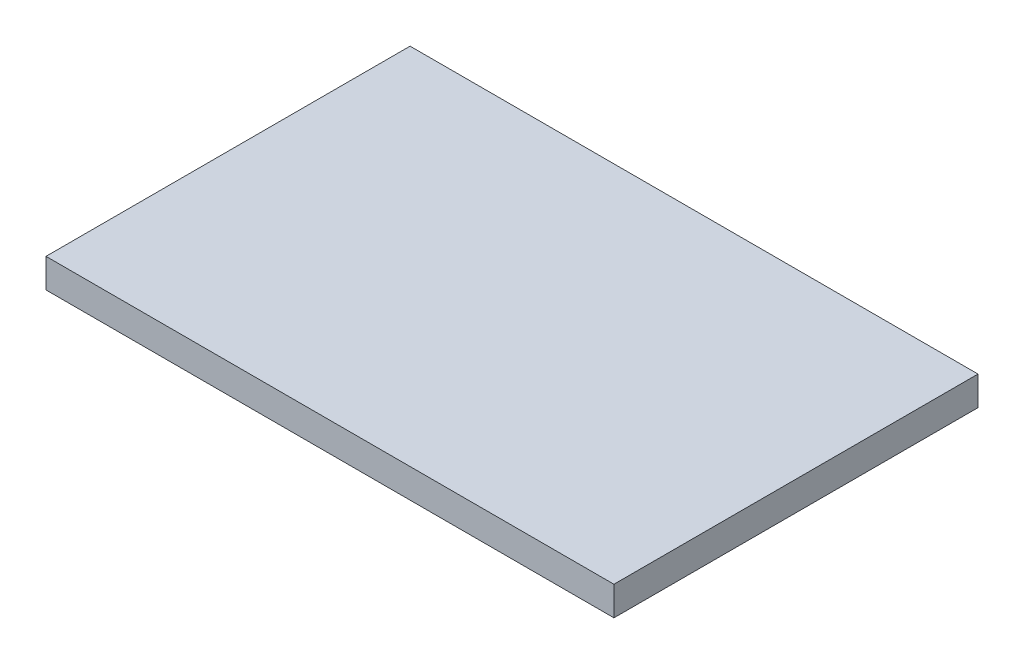
ISO-10303-21;
HEADER;
FILE_DESCRIPTION(('STEP AP214'),'2;1');
FILE_NAME('part.step','',(''),(''),'','','');
FILE_SCHEMA(('AUTOMOTIVE_DESIGN { 1 0 10303 214 1 1 1 1 }'));
ENDSEC;
DATA;
#1=APPLICATION_CONTEXT('core data for automotive mechanical design processes');
#2=APPLICATION_PROTOCOL_DEFINITION('international standard','automotive_design',2000,#1);
#3=PRODUCT_CONTEXT('',#1,'mechanical');
#4=PRODUCT('Part','Part','',(#3));
#5=PRODUCT_RELATED_PRODUCT_CATEGORY('part','',(#4));
#6=PRODUCT_DEFINITION_FORMATION('','',#4);
#7=PRODUCT_DEFINITION_CONTEXT('part definition',#1,'design');
#8=PRODUCT_DEFINITION('design','',#6,#7);
#9=PRODUCT_DEFINITION_SHAPE('','',#8);
#10=(LENGTH_UNIT() NAMED_UNIT(*) SI_UNIT(.MILLI.,.METRE.));
#11=(NAMED_UNIT(*) PLANE_ANGLE_UNIT() SI_UNIT($,.RADIAN.));
#12=(NAMED_UNIT(*) SI_UNIT($,.STERADIAN.) SOLID_ANGLE_UNIT());
#13=UNCERTAINTY_MEASURE_WITH_UNIT(LENGTH_MEASURE(1.E-05),#10,'distance_accuracy_value','');
#14=(GEOMETRIC_REPRESENTATION_CONTEXT(3) GLOBAL_UNCERTAINTY_ASSIGNED_CONTEXT((#13)) GLOBAL_UNIT_ASSIGNED_CONTEXT((#10,
#11,#12)) REPRESENTATION_CONTEXT('',''));
#15=CARTESIAN_POINT('',(0.,0.,0.));
#16=DIRECTION('',(0.,0.,1.));
#17=DIRECTION('',(1.,0.,0.));
#18=AXIS2_PLACEMENT_3D('',#15,#16,#17);
#19=CARTESIAN_POINT('',(39.,4.,25.));
#20=DIRECTION('',(-1.,0.,0.));
#21=DIRECTION('',(0.,0.,1.));
#22=AXIS2_PLACEMENT_3D('',#19,#20,#21);
#23=PLANE('',#22);
#24=DIRECTION('',(0.,0.,-1.));
#25=VECTOR('',#24,1.);
#26=CARTESIAN_POINT('',(39.,0.,25.));
#27=LINE('',#26,#25);
#28=CARTESIAN_POINT('',(39.,0.,25.));
#29=VERTEX_POINT('',#28);
#30=CARTESIAN_POINT('',(39.,0.,-25.));
#31=VERTEX_POINT('',#30);
#32=EDGE_CURVE('E111',#29,#31,#27,.T.);
#33=ORIENTED_EDGE('',*,*,#32,.T.);
#34=DIRECTION('',(0.,-1.,0.));
#35=VECTOR('',#34,1.);
#36=CARTESIAN_POINT('',(39.,4.,-25.));
#37=LINE('',#36,#35);
#38=CARTESIAN_POINT('',(39.,4.,-25.));
#39=VERTEX_POINT('',#38);
#40=EDGE_CURVE('E11',#39,#31,#37,.T.);
#41=ORIENTED_EDGE('',*,*,#40,.F.);
#42=DIRECTION('',(0.,0.,-1.));
#43=VECTOR('',#42,1.);
#44=CARTESIAN_POINT('',(39.,4.,25.));
#45=LINE('',#44,#43);
#46=CARTESIAN_POINT('',(39.,4.,25.));
#47=VERTEX_POINT('',#46);
#48=EDGE_CURVE('E95',#47,#39,#45,.T.);
#49=ORIENTED_EDGE('',*,*,#48,.F.);
#50=DIRECTION('',(0.,-1.,0.));
#51=VECTOR('',#50,1.);
#52=CARTESIAN_POINT('',(39.,4.,25.));
#53=LINE('',#52,#51);
#54=EDGE_CURVE('E107',#47,#29,#53,.T.);
#55=ORIENTED_EDGE('',*,*,#54,.T.);
#56=EDGE_LOOP('',(#33,#41,#49,#55));
#57=FACE_BOUND('',#56,.T.);
#58=ADVANCED_FACE('F43',(#57),#23,.F.);
#59=CARTESIAN_POINT('',(-39.,4.,-25.));
#60=DIRECTION('',(0.,0.,1.));
#61=DIRECTION('',(1.,0.,0.));
#62=AXIS2_PLACEMENT_3D('',#59,#60,#61);
#63=PLANE('',#62);
#64=DIRECTION('',(-1.,0.,0.));
#65=VECTOR('',#64,1.);
#66=CARTESIAN_POINT('',(-39.,0.,-25.));
#67=LINE('',#66,#65);
#68=CARTESIAN_POINT('',(-39.,0.,-25.));
#69=VERTEX_POINT('',#68);
#70=EDGE_CURVE('E100',#31,#69,#67,.T.);
#71=ORIENTED_EDGE('',*,*,#70,.T.);
#72=DIRECTION('',(0.,-1.,0.));
#73=VECTOR('',#72,1.);
#74=CARTESIAN_POINT('',(-39.,4.,-25.));
#75=LINE('',#74,#73);
#76=CARTESIAN_POINT('',(-39.,4.,-25.));
#77=VERTEX_POINT('',#76);
#78=EDGE_CURVE('E52',#77,#69,#75,.T.);
#79=ORIENTED_EDGE('',*,*,#78,.F.);
#80=DIRECTION('',(-1.,0.,0.));
#81=VECTOR('',#80,1.);
#82=CARTESIAN_POINT('',(-39.,4.,-25.));
#83=LINE('',#82,#81);
#84=EDGE_CURVE('E90',#39,#77,#83,.T.);
#85=ORIENTED_EDGE('',*,*,#84,.F.);
#86=ORIENTED_EDGE('',*,*,#40,.T.);
#87=EDGE_LOOP('',(#71,#79,#85,#86));
#88=FACE_BOUND('',#87,.T.);
#89=ADVANCED_FACE('F99',(#88),#63,.F.);
#90=CARTESIAN_POINT('',(-39.,4.,25.));
#91=DIRECTION('',(1.,0.,0.));
#92=DIRECTION('',(0.,0.,-1.));
#93=AXIS2_PLACEMENT_3D('',#90,#91,#92);
#94=PLANE('',#93);
#95=DIRECTION('',(0.,0.,1.));
#96=VECTOR('',#95,1.);
#97=CARTESIAN_POINT('',(-39.,0.,25.));
#98=LINE('',#97,#96);
#99=CARTESIAN_POINT('',(-39.,0.,25.));
#100=VERTEX_POINT('',#99);
#101=EDGE_CURVE('E77',#69,#100,#98,.T.);
#102=ORIENTED_EDGE('',*,*,#101,.T.);
#103=DIRECTION('',(0.,-1.,0.));
#104=VECTOR('',#103,1.);
#105=CARTESIAN_POINT('',(-39.,4.,25.));
#106=LINE('',#105,#104);
#107=CARTESIAN_POINT('',(-39.,4.,25.));
#108=VERTEX_POINT('',#107);
#109=EDGE_CURVE('E102',#108,#100,#106,.T.);
#110=ORIENTED_EDGE('',*,*,#109,.F.);
#111=DIRECTION('',(0.,0.,1.));
#112=VECTOR('',#111,1.);
#113=CARTESIAN_POINT('',(-39.,4.,25.));
#114=LINE('',#113,#112);
#115=EDGE_CURVE('E93',#77,#108,#114,.T.);
#116=ORIENTED_EDGE('',*,*,#115,.F.);
#117=ORIENTED_EDGE('',*,*,#78,.T.);
#118=EDGE_LOOP('',(#102,#110,#116,#117));
#119=FACE_BOUND('',#118,.T.);
#120=ADVANCED_FACE('F103',(#119),#94,.F.);
#121=CARTESIAN_POINT('',(-39.,4.,25.));
#122=DIRECTION('',(0.,0.,-1.));
#123=DIRECTION('',(-1.,0.,0.));
#124=AXIS2_PLACEMENT_3D('',#121,#122,#123);
#125=PLANE('',#124);
#126=DIRECTION('',(1.,0.,0.));
#127=VECTOR('',#126,1.);
#128=CARTESIAN_POINT('',(-39.,0.,25.));
#129=LINE('',#128,#127);
#130=EDGE_CURVE('E83',#100,#29,#129,.T.);
#131=ORIENTED_EDGE('',*,*,#130,.T.);
#132=ORIENTED_EDGE('',*,*,#54,.F.);
#133=DIRECTION('',(1.,0.,0.));
#134=VECTOR('',#133,1.);
#135=CARTESIAN_POINT('',(-39.,4.,25.));
#136=LINE('',#135,#134);
#137=EDGE_CURVE('E60',#108,#47,#136,.T.);
#138=ORIENTED_EDGE('',*,*,#137,.F.);
#139=ORIENTED_EDGE('',*,*,#109,.T.);
#140=EDGE_LOOP('',(#131,#132,#138,#139));
#141=FACE_BOUND('',#140,.T.);
#142=ADVANCED_FACE('F124',(#141),#125,.F.);
#143=CARTESIAN_POINT('',(0.,4.,0.));
#144=DIRECTION('',(0.,-1.,0.));
#145=DIRECTION('',(0.,0.,-1.));
#146=AXIS2_PLACEMENT_3D('',#143,#144,#145);
#147=PLANE('',#146);
#148=ORIENTED_EDGE('',*,*,#48,.T.);
#149=ORIENTED_EDGE('',*,*,#84,.T.);
#150=ORIENTED_EDGE('',*,*,#115,.T.);
#151=ORIENTED_EDGE('',*,*,#137,.T.);
#152=EDGE_LOOP('',(#148,#149,#150,#151));
#153=FACE_BOUND('',#152,.T.);
#154=ADVANCED_FACE('F91',(#153),#147,.F.);
#155=CARTESIAN_POINT('',(0.,0.,0.));
#156=DIRECTION('',(0.,-1.,0.));
#157=DIRECTION('',(0.,0.,-1.));
#158=AXIS2_PLACEMENT_3D('',#155,#156,#157);
#159=PLANE('',#158);
#160=ORIENTED_EDGE('',*,*,#32,.F.);
#161=ORIENTED_EDGE('',*,*,#130,.F.);
#162=ORIENTED_EDGE('',*,*,#101,.F.);
#163=ORIENTED_EDGE('',*,*,#70,.F.);
#164=EDGE_LOOP('',(#160,#161,#162,#163));
#165=FACE_BOUND('',#164,.T.);
#166=ADVANCED_FACE('F127',(#165),#159,.T.);
#167=CLOSED_SHELL('',(#58,#89,#120,#142,#154,#166));
#168=MANIFOLD_SOLID_BREP('B2',#167);
#169=ADVANCED_BREP_SHAPE_REPRESENTATION('',(#18,#168),#14);
#170=SHAPE_DEFINITION_REPRESENTATION(#9,#169);
ENDSEC;
END-ISO-10303-21;
